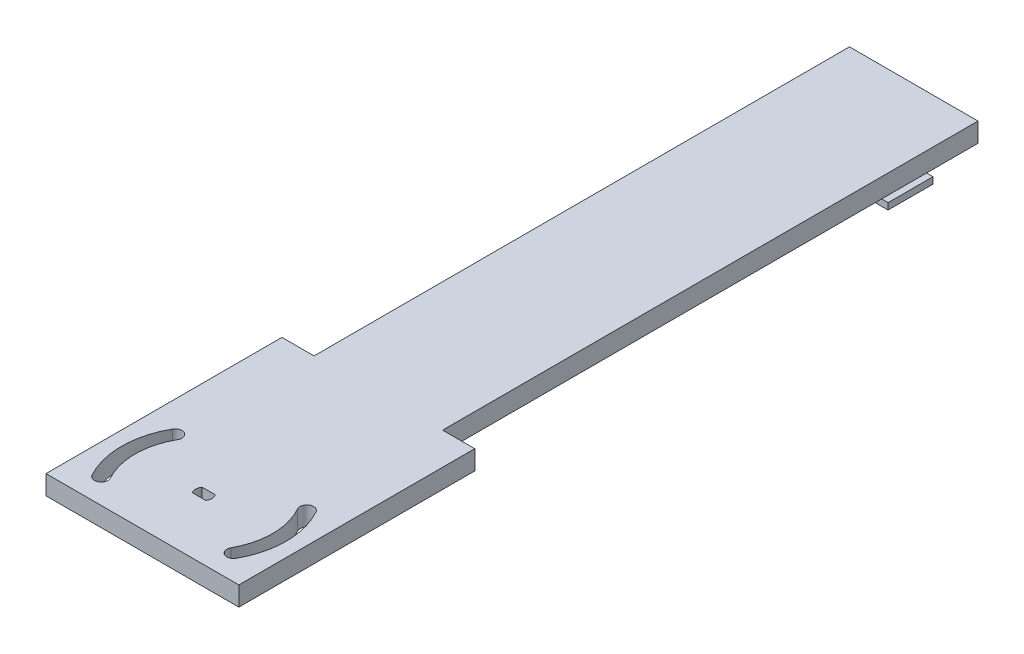
ISO-10303-21;
HEADER;
FILE_DESCRIPTION(('STEP AP214'),'2;1');
FILE_NAME('part.step','',(''),(''),'','','');
FILE_SCHEMA(('AUTOMOTIVE_DESIGN { 1 0 10303 214 1 1 1 1 }'));
ENDSEC;
DATA;
#1=APPLICATION_CONTEXT('core data for automotive mechanical design processes');
#2=APPLICATION_PROTOCOL_DEFINITION('international standard','automotive_design',2000,#1);
#3=PRODUCT_CONTEXT('',#1,'mechanical');
#4=PRODUCT('Part','Part','',(#3));
#5=PRODUCT_RELATED_PRODUCT_CATEGORY('part','',(#4));
#6=PRODUCT_DEFINITION_FORMATION('','',#4);
#7=PRODUCT_DEFINITION_CONTEXT('part definition',#1,'design');
#8=PRODUCT_DEFINITION('design','',#6,#7);
#9=PRODUCT_DEFINITION_SHAPE('','',#8);
#10=(LENGTH_UNIT() NAMED_UNIT(*) SI_UNIT(.MILLI.,.METRE.));
#11=(NAMED_UNIT(*) PLANE_ANGLE_UNIT() SI_UNIT($,.RADIAN.));
#12=(NAMED_UNIT(*) SI_UNIT($,.STERADIAN.) SOLID_ANGLE_UNIT());
#13=UNCERTAINTY_MEASURE_WITH_UNIT(LENGTH_MEASURE(1.E-05),#10,'distance_accuracy_value','');
#14=(GEOMETRIC_REPRESENTATION_CONTEXT(3) GLOBAL_UNCERTAINTY_ASSIGNED_CONTEXT((#13)) GLOBAL_UNIT_ASSIGNED_CONTEXT((#10,
#11,#12)) REPRESENTATION_CONTEXT('',''));
#15=CARTESIAN_POINT('',(0.,0.,0.));
#16=DIRECTION('',(0.,0.,1.));
#17=DIRECTION('',(1.,0.,0.));
#18=AXIS2_PLACEMENT_3D('',#15,#16,#17);
#19=CARTESIAN_POINT('',(0.,0.,0.));
#20=DIRECTION('',(0.,-1.,0.));
#21=DIRECTION('',(0.,0.,-1.));
#22=AXIS2_PLACEMENT_3D('',#19,#20,#21);
#23=PLANE('',#22);
#24=CARTESIAN_POINT('',(0.,0.,100.874369573321));
#25=DIRECTION('',(0.,-1.,0.));
#26=DIRECTION('',(0.,0.,1.));
#27=AXIS2_PLACEMENT_3D('',#24,#25,#26);
#28=CIRCLE('',#27,25.62);
#29=CARTESIAN_POINT('',(22.3176552587879,0.,88.2923719676189));
#30=VERTEX_POINT('',#29);
#31=CARTESIAN_POINT('',(22.4486515802957,0.,113.221127942484));
#32=VERTEX_POINT('',#31);
#33=EDGE_CURVE('E61',#30,#32,#28,.T.);
#34=ORIENTED_EDGE('',*,*,#33,.F.);
#35=CARTESIAN_POINT('',(20.4883392539692,0.,89.3236832467748));
#36=DIRECTION('',(0.,-1.,0.));
#37=DIRECTION('',(0.,0.,-1.));
#38=AXIS2_PLACEMENT_3D('',#35,#36,#37);
#39=CIRCLE('',#38,2.10000000000001);
#40=CARTESIAN_POINT('',(18.6590232491505,0.,90.3549945259307));
#41=VERTEX_POINT('',#40);
#42=EDGE_CURVE('E281',#41,#30,#39,.T.);
#43=ORIENTED_EDGE('',*,*,#42,.F.);
#44=CARTESIAN_POINT('',(0.,0.,100.874369573321));
#45=DIRECTION('',(0.,1.,0.));
#46=DIRECTION('',(0.,0.,1.));
#47=AXIS2_PLACEMENT_3D('',#44,#45,#46);
#48=CIRCLE('',#47,21.42);
#49=CARTESIAN_POINT('',(18.7685447638537,0.,111.197069193441));
#50=VERTEX_POINT('',#49);
#51=EDGE_CURVE('E285',#50,#41,#48,.T.);
#52=ORIENTED_EDGE('',*,*,#51,.F.);
#53=CARTESIAN_POINT('',(20.6085981720747,0.,112.209098567962));
#54=DIRECTION('',(0.,-1.,0.));
#55=DIRECTION('',(0.,0.,-1.));
#56=AXIS2_PLACEMENT_3D('',#53,#54,#55);
#57=CIRCLE('',#56,2.1);
#58=EDGE_CURVE('E240',#32,#50,#57,.T.);
#59=ORIENTED_EDGE('',*,*,#58,.F.);
#60=EDGE_LOOP('',(#34,#43,#52,#59));
#61=FACE_BOUND('',#60,.T.);
#62=CARTESIAN_POINT('',(-20.6085981720747,0.,112.209098567962));
#63=DIRECTION('',(0.,-1.,0.));
#64=DIRECTION('',(0.,0.,1.));
#65=AXIS2_PLACEMENT_3D('',#62,#63,#64);
#66=CIRCLE('',#65,2.1);
#67=CARTESIAN_POINT('',(-18.7685447638538,0.,111.197069193441));
#68=VERTEX_POINT('',#67);
#69=CARTESIAN_POINT('',(-22.4486515802957,0.,113.221127942484));
#70=VERTEX_POINT('',#69);
#71=EDGE_CURVE('E69',#68,#70,#66,.T.);
#72=ORIENTED_EDGE('',*,*,#71,.F.);
#73=CARTESIAN_POINT('',(0.,0.,100.874369573321));
#74=DIRECTION('',(0.,1.,0.));
#75=DIRECTION('',(0.,0.,1.));
#76=AXIS2_PLACEMENT_3D('',#73,#74,#75);
#77=CIRCLE('',#76,21.42);
#78=CARTESIAN_POINT('',(-18.6590232491505,0.,90.3549945259307));
#79=VERTEX_POINT('',#78);
#80=EDGE_CURVE('E243',#79,#68,#77,.T.);
#81=ORIENTED_EDGE('',*,*,#80,.F.);
#82=CARTESIAN_POINT('',(-20.4883392539692,0.,89.3236832467748));
#83=DIRECTION('',(0.,-1.,0.));
#84=DIRECTION('',(0.,0.,1.));
#85=AXIS2_PLACEMENT_3D('',#82,#83,#84);
#86=CIRCLE('',#85,2.1);
#87=CARTESIAN_POINT('',(-22.3176552587879,0.,88.2923719676189));
#88=VERTEX_POINT('',#87);
#89=EDGE_CURVE('E250',#88,#79,#86,.T.);
#90=ORIENTED_EDGE('',*,*,#89,.F.);
#91=CARTESIAN_POINT('',(0.,0.,100.874369573321));
#92=DIRECTION('',(0.,-1.,0.));
#93=DIRECTION('',(0.,0.,-1.));
#94=AXIS2_PLACEMENT_3D('',#91,#92,#93);
#95=CIRCLE('',#94,25.62);
#96=EDGE_CURVE('E256',#70,#88,#95,.T.);
#97=ORIENTED_EDGE('',*,*,#96,.F.);
#98=EDGE_LOOP('',(#72,#81,#90,#97));
#99=FACE_BOUND('',#98,.T.);
#100=CARTESIAN_POINT('',(0.,0.,100.874369573321));
#101=DIRECTION('',(0.,-1.,0.));
#102=DIRECTION('',(0.,0.,-1.));
#103=AXIS2_PLACEMENT_3D('',#100,#101,#102);
#104=CIRCLE('',#103,2.54017715917611);
#105=CARTESIAN_POINT('',(-2.05000000000002,0.,102.374369573321));
#106=VERTEX_POINT('',#105);
#107=CARTESIAN_POINT('',(-2.05000000000002,0.,99.3743695733212));
#108=VERTEX_POINT('',#107);
#109=EDGE_CURVE('E258',#106,#108,#104,.T.);
#110=ORIENTED_EDGE('',*,*,#109,.F.);
#111=DIRECTION('',(-1.,0.,0.));
#112=VECTOR('',#111,1.);
#113=CARTESIAN_POINT('',(-2.05000000000002,0.,102.374369573321));
#114=LINE('',#113,#112);
#115=CARTESIAN_POINT('',(2.04999999999998,0.,102.374369573321));
#116=VERTEX_POINT('',#115);
#117=EDGE_CURVE('E299',#116,#106,#114,.T.);
#118=ORIENTED_EDGE('',*,*,#117,.F.);
#119=CARTESIAN_POINT('',(0.,0.,100.874369573321));
#120=DIRECTION('',(0.,-1.,0.));
#121=DIRECTION('',(0.,0.,-1.));
#122=AXIS2_PLACEMENT_3D('',#119,#120,#121);
#123=CIRCLE('',#122,2.54017715917611);
#124=CARTESIAN_POINT('',(2.04999999999998,0.,99.3743695733212));
#125=VERTEX_POINT('',#124);
#126=EDGE_CURVE('E295',#125,#116,#123,.T.);
#127=ORIENTED_EDGE('',*,*,#126,.F.);
#128=DIRECTION('',(1.,0.,0.));
#129=VECTOR('',#128,1.);
#130=CARTESIAN_POINT('',(-2.05000000000002,0.,99.3743695733212));
#131=LINE('',#130,#129);
#132=EDGE_CURVE('E262',#108,#125,#131,.T.);
#133=ORIENTED_EDGE('',*,*,#132,.F.);
#134=EDGE_LOOP('',(#110,#118,#127,#133));
#135=FACE_BOUND('',#134,.T.);
#136=DIRECTION('',(0.,0.,-1.));
#137=VECTOR('',#136,1.);
#138=CARTESIAN_POINT('',(20.,0.,120.));
#139=LINE('',#138,#137);
#140=CARTESIAN_POINT('',(20.,0.,46.5869361591004));
#141=VERTEX_POINT('',#140);
#142=CARTESIAN_POINT('',(20.,0.,-120.));
#143=VERTEX_POINT('',#142);
#144=EDGE_CURVE('E448',#141,#143,#139,.T.);
#145=ORIENTED_EDGE('',*,*,#144,.F.);
#146=DIRECTION('',(1.,0.,0.));
#147=VECTOR('',#146,1.);
#148=CARTESIAN_POINT('',(-30.,0.,46.5869361591004));
#149=LINE('',#148,#147);
#150=CARTESIAN_POINT('',(30.,0.,46.5869361591004));
#151=VERTEX_POINT('',#150);
#152=EDGE_CURVE('E431',#141,#151,#149,.T.);
#153=ORIENTED_EDGE('',*,*,#152,.T.);
#154=DIRECTION('',(0.,0.,-1.));
#155=VECTOR('',#154,1.);
#156=CARTESIAN_POINT('',(30.,0.,120.));
#157=LINE('',#156,#155);
#158=CARTESIAN_POINT('',(30.,0.,120.));
#159=VERTEX_POINT('',#158);
#160=EDGE_CURVE('E403',#159,#151,#157,.T.);
#161=ORIENTED_EDGE('',*,*,#160,.F.);
#162=DIRECTION('',(1.,0.,0.));
#163=VECTOR('',#162,1.);
#164=CARTESIAN_POINT('',(-20.,0.,120.));
#165=LINE('',#164,#163);
#166=CARTESIAN_POINT('',(-30.,0.,120.));
#167=VERTEX_POINT('',#166);
#168=EDGE_CURVE('E453',#167,#159,#165,.T.);
#169=ORIENTED_EDGE('',*,*,#168,.F.);
#170=DIRECTION('',(0.,0.,-1.));
#171=VECTOR('',#170,1.);
#172=CARTESIAN_POINT('',(-30.,0.,120.));
#173=LINE('',#172,#171);
#174=CARTESIAN_POINT('',(-30.,0.,46.5869361591004));
#175=VERTEX_POINT('',#174);
#176=EDGE_CURVE('E419',#167,#175,#173,.T.);
#177=ORIENTED_EDGE('',*,*,#176,.T.);
#178=CARTESIAN_POINT('',(-20.,0.,46.5869361591004));
#179=VERTEX_POINT('',#178);
#180=EDGE_CURVE('E438',#175,#179,#149,.T.);
#181=ORIENTED_EDGE('',*,*,#180,.T.);
#182=DIRECTION('',(0.,0.,1.));
#183=VECTOR('',#182,1.);
#184=CARTESIAN_POINT('',(-20.,0.,120.));
#185=LINE('',#184,#183);
#186=CARTESIAN_POINT('',(-20.,0.,-120.));
#187=VERTEX_POINT('',#186);
#188=EDGE_CURVE('E469',#187,#179,#185,.T.);
#189=ORIENTED_EDGE('',*,*,#188,.F.);
#190=DIRECTION('',(-1.,0.,0.));
#191=VECTOR('',#190,1.);
#192=CARTESIAN_POINT('',(-20.,0.,-120.));
#193=LINE('',#192,#191);
#194=EDGE_CURVE('E466',#143,#187,#193,.T.);
#195=ORIENTED_EDGE('',*,*,#194,.F.);
#196=EDGE_LOOP('',(#145,#153,#161,#169,#177,#181,#189,#195));
#197=FACE_BOUND('',#196,.T.);
#198=DIRECTION('',(1.,0.,0.));
#199=VECTOR('',#198,1.);
#200=CARTESIAN_POINT('',(-14.,0.,-110.));
#201=LINE('',#200,#199);
#202=CARTESIAN_POINT('',(-14.,0.,-110.));
#203=VERTEX_POINT('',#202);
#204=CARTESIAN_POINT('',(14.,0.,-110.));
#205=VERTEX_POINT('',#204);
#206=EDGE_CURVE('E377',#203,#205,#201,.T.);
#207=ORIENTED_EDGE('',*,*,#206,.F.);
#208=DIRECTION('',(0.,0.,-1.));
#209=VECTOR('',#208,1.);
#210=CARTESIAN_POINT('',(-14.,0.,-110.));
#211=LINE('',#210,#209);
#212=CARTESIAN_POINT('',(-14.,0.,-96.));
#213=VERTEX_POINT('',#212);
#214=EDGE_CURVE('E365',#213,#203,#211,.T.);
#215=ORIENTED_EDGE('',*,*,#214,.F.);
#216=DIRECTION('',(-1.,0.,0.));
#217=VECTOR('',#216,1.);
#218=CARTESIAN_POINT('',(-14.,0.,-96.));
#219=LINE('',#218,#217);
#220=CARTESIAN_POINT('',(14.,0.,-96.));
#221=VERTEX_POINT('',#220);
#222=EDGE_CURVE('E370',#221,#213,#219,.T.);
#223=ORIENTED_EDGE('',*,*,#222,.F.);
#224=DIRECTION('',(0.,0.,1.));
#225=VECTOR('',#224,1.);
#226=CARTESIAN_POINT('',(14.,0.,-110.));
#227=LINE('',#226,#225);
#228=EDGE_CURVE('E381',#205,#221,#227,.T.);
#229=ORIENTED_EDGE('',*,*,#228,.F.);
#230=EDGE_LOOP('',(#207,#215,#223,#229));
#231=FACE_BOUND('',#230,.T.);
#232=ADVANCED_FACE('F45',(#61,#99,#135,#197,#231),#23,.T.);
#233=CARTESIAN_POINT('',(20.,6.,120.));
#234=DIRECTION('',(-1.,0.,0.));
#235=DIRECTION('',(0.,0.,1.));
#236=AXIS2_PLACEMENT_3D('',#233,#234,#235);
#237=PLANE('',#236);
#238=DIRECTION('',(0.,0.,-1.));
#239=VECTOR('',#238,1.);
#240=CARTESIAN_POINT('',(20.,6.,120.));
#241=LINE('',#240,#239);
#242=CARTESIAN_POINT('',(20.,6.,46.5869361591004));
#243=VERTEX_POINT('',#242);
#244=CARTESIAN_POINT('',(20.,6.,-120.));
#245=VERTEX_POINT('',#244);
#246=EDGE_CURVE('E449',#243,#245,#241,.T.);
#247=ORIENTED_EDGE('',*,*,#246,.F.);
#248=DIRECTION('',(0.,-1.,0.));
#249=VECTOR('',#248,1.);
#250=CARTESIAN_POINT('',(20.,6.,46.5869361591004));
#251=LINE('',#250,#249);
#252=EDGE_CURVE('E444',#243,#141,#251,.T.);
#253=ORIENTED_EDGE('',*,*,#252,.T.);
#254=ORIENTED_EDGE('',*,*,#144,.T.);
#255=DIRECTION('',(0.,-1.,0.));
#256=VECTOR('',#255,1.);
#257=CARTESIAN_POINT('',(20.,6.,-120.));
#258=LINE('',#257,#256);
#259=EDGE_CURVE('E477',#245,#143,#258,.T.);
#260=ORIENTED_EDGE('',*,*,#259,.F.);
#261=EDGE_LOOP('',(#247,#253,#254,#260));
#262=FACE_BOUND('',#261,.T.);
#263=ADVANCED_FACE('F47',(#262),#237,.F.);
#264=CARTESIAN_POINT('',(-20.,6.,-120.));
#265=DIRECTION('',(0.,0.,1.));
#266=DIRECTION('',(1.,0.,0.));
#267=AXIS2_PLACEMENT_3D('',#264,#265,#266);
#268=PLANE('',#267);
#269=ORIENTED_EDGE('',*,*,#194,.T.);
#270=DIRECTION('',(0.,-1.,0.));
#271=VECTOR('',#270,1.);
#272=CARTESIAN_POINT('',(-20.,6.,-120.));
#273=LINE('',#272,#271);
#274=CARTESIAN_POINT('',(-20.,6.,-120.));
#275=VERTEX_POINT('',#274);
#276=EDGE_CURVE('E463',#275,#187,#273,.T.);
#277=ORIENTED_EDGE('',*,*,#276,.F.);
#278=DIRECTION('',(-1.,0.,0.));
#279=VECTOR('',#278,1.);
#280=CARTESIAN_POINT('',(-20.,6.,-120.));
#281=LINE('',#280,#279);
#282=EDGE_CURVE('E452',#245,#275,#281,.T.);
#283=ORIENTED_EDGE('',*,*,#282,.F.);
#284=ORIENTED_EDGE('',*,*,#259,.T.);
#285=EDGE_LOOP('',(#269,#277,#283,#284));
#286=FACE_BOUND('',#285,.T.);
#287=ADVANCED_FACE('F555',(#286),#268,.F.);
#288=CARTESIAN_POINT('',(-20.,6.,120.));
#289=DIRECTION('',(1.,0.,0.));
#290=DIRECTION('',(0.,0.,-1.));
#291=AXIS2_PLACEMENT_3D('',#288,#289,#290);
#292=PLANE('',#291);
#293=ORIENTED_EDGE('',*,*,#188,.T.);
#294=DIRECTION('',(0.,1.,0.));
#295=VECTOR('',#294,1.);
#296=CARTESIAN_POINT('',(-20.,6.,46.5869361591004));
#297=LINE('',#296,#295);
#298=CARTESIAN_POINT('',(-20.,6.,46.5869361591004));
#299=VERTEX_POINT('',#298);
#300=EDGE_CURVE('E436',#179,#299,#297,.T.);
#301=ORIENTED_EDGE('',*,*,#300,.T.);
#302=DIRECTION('',(0.,0.,1.));
#303=VECTOR('',#302,1.);
#304=CARTESIAN_POINT('',(-20.,6.,120.));
#305=LINE('',#304,#303);
#306=EDGE_CURVE('E456',#275,#299,#305,.T.);
#307=ORIENTED_EDGE('',*,*,#306,.F.);
#308=ORIENTED_EDGE('',*,*,#276,.T.);
#309=EDGE_LOOP('',(#293,#301,#307,#308));
#310=FACE_BOUND('',#309,.T.);
#311=ADVANCED_FACE('F563',(#310),#292,.F.);
#312=CARTESIAN_POINT('',(-20.,6.,120.));
#313=DIRECTION('',(0.,0.,-1.));
#314=DIRECTION('',(-1.,0.,0.));
#315=AXIS2_PLACEMENT_3D('',#312,#313,#314);
#316=PLANE('',#315);
#317=ORIENTED_EDGE('',*,*,#168,.T.);
#318=DIRECTION('',(0.,-1.,0.));
#319=VECTOR('',#318,1.);
#320=CARTESIAN_POINT('',(30.,6.,120.));
#321=LINE('',#320,#319);
#322=CARTESIAN_POINT('',(30.,6.,120.));
#323=VERTEX_POINT('',#322);
#324=EDGE_CURVE('E399',#323,#159,#321,.T.);
#325=ORIENTED_EDGE('',*,*,#324,.F.);
#326=DIRECTION('',(1.,0.,0.));
#327=VECTOR('',#326,1.);
#328=CARTESIAN_POINT('',(-20.,6.,120.));
#329=LINE('',#328,#327);
#330=CARTESIAN_POINT('',(-30.,6.,120.));
#331=VERTEX_POINT('',#330);
#332=EDGE_CURVE('E460',#331,#323,#329,.T.);
#333=ORIENTED_EDGE('',*,*,#332,.F.);
#334=DIRECTION('',(0.,-1.,0.));
#335=VECTOR('',#334,1.);
#336=CARTESIAN_POINT('',(-30.,6.,120.));
#337=LINE('',#336,#335);
#338=EDGE_CURVE('E415',#331,#167,#337,.T.);
#339=ORIENTED_EDGE('',*,*,#338,.T.);
#340=EDGE_LOOP('',(#317,#325,#333,#339));
#341=FACE_BOUND('',#340,.T.);
#342=ADVANCED_FACE('F560',(#341),#316,.F.);
#343=CARTESIAN_POINT('',(0.,6.,0.));
#344=DIRECTION('',(0.,-1.,0.));
#345=DIRECTION('',(0.,0.,-1.));
#346=AXIS2_PLACEMENT_3D('',#343,#344,#345);
#347=PLANE('',#346);
#348=CARTESIAN_POINT('',(20.4883392539692,6.,89.3236832467748));
#349=DIRECTION('',(0.,-1.,0.));
#350=DIRECTION('',(0.,0.,-1.));
#351=AXIS2_PLACEMENT_3D('',#348,#349,#350);
#352=CIRCLE('',#351,2.10000000000001);
#353=CARTESIAN_POINT('',(18.6590232491505,6.,90.3549945259307));
#354=VERTEX_POINT('',#353);
#355=CARTESIAN_POINT('',(22.3176552587879,6.,88.2923719676189));
#356=VERTEX_POINT('',#355);
#357=EDGE_CURVE('E54',#354,#356,#352,.T.);
#358=ORIENTED_EDGE('',*,*,#357,.T.);
#359=CARTESIAN_POINT('',(0.,6.,100.874369573321));
#360=DIRECTION('',(0.,-1.,0.));
#361=DIRECTION('',(0.,0.,-1.));
#362=AXIS2_PLACEMENT_3D('',#359,#360,#361);
#363=CIRCLE('',#362,25.62);
#364=CARTESIAN_POINT('',(22.4486515802957,6.,113.221127942484));
#365=VERTEX_POINT('',#364);
#366=EDGE_CURVE('E11',#356,#365,#363,.T.);
#367=ORIENTED_EDGE('',*,*,#366,.T.);
#368=CARTESIAN_POINT('',(20.6085981720747,6.,112.209098567962));
#369=DIRECTION('',(0.,-1.,0.));
#370=DIRECTION('',(0.,0.,-1.));
#371=AXIS2_PLACEMENT_3D('',#368,#369,#370);
#372=CIRCLE('',#371,2.1);
#373=CARTESIAN_POINT('',(18.7685447638537,6.,111.197069193441));
#374=VERTEX_POINT('',#373);
#375=EDGE_CURVE('E510',#365,#374,#372,.T.);
#376=ORIENTED_EDGE('',*,*,#375,.T.);
#377=CARTESIAN_POINT('',(0.,6.,100.874369573321));
#378=DIRECTION('',(0.,-1.,0.));
#379=DIRECTION('',(0.,0.,-1.));
#380=AXIS2_PLACEMENT_3D('',#377,#378,#379);
#381=CIRCLE('',#380,21.42);
#382=EDGE_CURVE('E514',#374,#354,#381,.F.);
#383=ORIENTED_EDGE('',*,*,#382,.T.);
#384=EDGE_LOOP('',(#358,#367,#376,#383));
#385=FACE_BOUND('',#384,.T.);
#386=CARTESIAN_POINT('',(0.,6.,100.874369573321));
#387=DIRECTION('',(0.,-1.,0.));
#388=DIRECTION('',(0.,0.,-1.));
#389=AXIS2_PLACEMENT_3D('',#386,#387,#388);
#390=CIRCLE('',#389,21.42);
#391=CARTESIAN_POINT('',(-18.6590232491505,6.,90.3549945259307));
#392=VERTEX_POINT('',#391);
#393=CARTESIAN_POINT('',(-18.7685447638538,6.,111.197069193441));
#394=VERTEX_POINT('',#393);
#395=EDGE_CURVE('E505',#392,#394,#390,.F.);
#396=ORIENTED_EDGE('',*,*,#395,.T.);
#397=CARTESIAN_POINT('',(-20.6085981720747,6.,112.209098567962));
#398=DIRECTION('',(0.,-1.,0.));
#399=DIRECTION('',(0.,0.,-1.));
#400=AXIS2_PLACEMENT_3D('',#397,#398,#399);
#401=CIRCLE('',#400,2.1);
#402=CARTESIAN_POINT('',(-22.4486515802957,6.,113.221127942484));
#403=VERTEX_POINT('',#402);
#404=EDGE_CURVE('E235',#394,#403,#401,.T.);
#405=ORIENTED_EDGE('',*,*,#404,.T.);
#406=CARTESIAN_POINT('',(0.,6.,100.874369573321));
#407=DIRECTION('',(0.,-1.,0.));
#408=DIRECTION('',(0.,0.,-1.));
#409=AXIS2_PLACEMENT_3D('',#406,#407,#408);
#410=CIRCLE('',#409,25.62);
#411=CARTESIAN_POINT('',(-22.3176552587879,6.,88.2923719676189));
#412=VERTEX_POINT('',#411);
#413=EDGE_CURVE('E497',#403,#412,#410,.T.);
#414=ORIENTED_EDGE('',*,*,#413,.T.);
#415=CARTESIAN_POINT('',(-20.4883392539692,6.,89.3236832467748));
#416=DIRECTION('',(0.,-1.,0.));
#417=DIRECTION('',(0.,0.,-1.));
#418=AXIS2_PLACEMENT_3D('',#415,#416,#417);
#419=CIRCLE('',#418,2.1);
#420=EDGE_CURVE('E501',#412,#392,#419,.T.);
#421=ORIENTED_EDGE('',*,*,#420,.T.);
#422=EDGE_LOOP('',(#396,#405,#414,#421));
#423=FACE_BOUND('',#422,.T.);
#424=DIRECTION('',(-1.,0.,0.));
#425=VECTOR('',#424,1.);
#426=CARTESIAN_POINT('',(0.,6.,102.374369573321));
#427=LINE('',#426,#425);
#428=CARTESIAN_POINT('',(2.04999999999998,6.,102.374369573321));
#429=VERTEX_POINT('',#428);
#430=CARTESIAN_POINT('',(-2.05000000000002,6.,102.374369573321));
#431=VERTEX_POINT('',#430);
#432=EDGE_CURVE('E489',#429,#431,#427,.T.);
#433=ORIENTED_EDGE('',*,*,#432,.T.);
#434=CARTESIAN_POINT('',(0.,6.,100.874369573321));
#435=DIRECTION('',(0.,-1.,0.));
#436=DIRECTION('',(0.,0.,-1.));
#437=AXIS2_PLACEMENT_3D('',#434,#435,#436);
#438=CIRCLE('',#437,2.54017715917611);
#439=CARTESIAN_POINT('',(-2.05000000000002,6.,99.3743695733212));
#440=VERTEX_POINT('',#439);
#441=EDGE_CURVE('E493',#431,#440,#438,.T.);
#442=ORIENTED_EDGE('',*,*,#441,.T.);
#443=DIRECTION('',(1.,0.,0.));
#444=VECTOR('',#443,1.);
#445=CARTESIAN_POINT('',(0.,6.,99.3743695733212));
#446=LINE('',#445,#444);
#447=CARTESIAN_POINT('',(2.04999999999998,6.,99.3743695733212));
#448=VERTEX_POINT('',#447);
#449=EDGE_CURVE('E481',#440,#448,#446,.T.);
#450=ORIENTED_EDGE('',*,*,#449,.T.);
#451=CARTESIAN_POINT('',(0.,6.,100.874369573321));
#452=DIRECTION('',(0.,-1.,0.));
#453=DIRECTION('',(0.,0.,-1.));
#454=AXIS2_PLACEMENT_3D('',#451,#452,#453);
#455=CIRCLE('',#454,2.54017715917611);
#456=EDGE_CURVE('E485',#448,#429,#455,.T.);
#457=ORIENTED_EDGE('',*,*,#456,.T.);
#458=EDGE_LOOP('',(#433,#442,#450,#457));
#459=FACE_BOUND('',#458,.T.);
#460=ORIENTED_EDGE('',*,*,#306,.T.);
#461=DIRECTION('',(1.,0.,0.));
#462=VECTOR('',#461,1.);
#463=CARTESIAN_POINT('',(-30.,6.,46.5869361591004));
#464=LINE('',#463,#462);
#465=CARTESIAN_POINT('',(-30.,6.,46.5869361591004));
#466=VERTEX_POINT('',#465);
#467=EDGE_CURVE('E432',#466,#299,#464,.T.);
#468=ORIENTED_EDGE('',*,*,#467,.F.);
#469=DIRECTION('',(0.,0.,1.));
#470=VECTOR('',#469,1.);
#471=CARTESIAN_POINT('',(-30.,6.,120.));
#472=LINE('',#471,#470);
#473=EDGE_CURVE('E427',#466,#331,#472,.T.);
#474=ORIENTED_EDGE('',*,*,#473,.T.);
#475=ORIENTED_EDGE('',*,*,#332,.T.);
#476=DIRECTION('',(0.,0.,1.));
#477=VECTOR('',#476,1.);
#478=CARTESIAN_POINT('',(30.,6.,120.));
#479=LINE('',#478,#477);
#480=CARTESIAN_POINT('',(30.,6.,46.5869361591004));
#481=VERTEX_POINT('',#480);
#482=EDGE_CURVE('E411',#481,#323,#479,.T.);
#483=ORIENTED_EDGE('',*,*,#482,.F.);
#484=EDGE_CURVE('E437',#243,#481,#464,.T.);
#485=ORIENTED_EDGE('',*,*,#484,.F.);
#486=ORIENTED_EDGE('',*,*,#246,.T.);
#487=ORIENTED_EDGE('',*,*,#282,.T.);
#488=EDGE_LOOP('',(#460,#468,#474,#475,#483,#485,#486,#487));
#489=FACE_BOUND('',#488,.T.);
#490=ADVANCED_FACE('F520',(#385,#423,#459,#489),#347,.F.);
#491=CARTESIAN_POINT('',(-30.,0.,0.));
#492=DIRECTION('',(1.,0.,0.));
#493=DIRECTION('',(0.,0.,-1.));
#494=AXIS2_PLACEMENT_3D('',#491,#492,#493);
#495=PLANE('',#494);
#496=ORIENTED_EDGE('',*,*,#338,.F.);
#497=ORIENTED_EDGE('',*,*,#473,.F.);
#498=DIRECTION('',(0.,1.,0.));
#499=VECTOR('',#498,1.);
#500=CARTESIAN_POINT('',(-30.,6.,46.5869361591004));
#501=LINE('',#500,#499);
#502=EDGE_CURVE('E423',#175,#466,#501,.T.);
#503=ORIENTED_EDGE('',*,*,#502,.F.);
#504=ORIENTED_EDGE('',*,*,#176,.F.);
#505=EDGE_LOOP('',(#496,#497,#503,#504));
#506=FACE_BOUND('',#505,.T.);
#507=ADVANCED_FACE('F587',(#506),#495,.F.);
#508=CARTESIAN_POINT('',(-30.,6.,46.5869361591004));
#509=DIRECTION('',(0.,0.,-1.));
#510=DIRECTION('',(-1.,0.,0.));
#511=AXIS2_PLACEMENT_3D('',#508,#509,#510);
#512=PLANE('',#511);
#513=ORIENTED_EDGE('',*,*,#300,.F.);
#514=ORIENTED_EDGE('',*,*,#180,.F.);
#515=ORIENTED_EDGE('',*,*,#502,.T.);
#516=ORIENTED_EDGE('',*,*,#467,.T.);
#517=EDGE_LOOP('',(#513,#514,#515,#516));
#518=FACE_BOUND('',#517,.T.);
#519=ADVANCED_FACE('F583',(#518),#512,.T.);
#520=ORIENTED_EDGE('',*,*,#252,.F.);
#521=ORIENTED_EDGE('',*,*,#484,.T.);
#522=DIRECTION('',(0.,1.,0.));
#523=VECTOR('',#522,1.);
#524=CARTESIAN_POINT('',(30.,6.,46.5869361591004));
#525=LINE('',#524,#523);
#526=EDGE_CURVE('E407',#151,#481,#525,.T.);
#527=ORIENTED_EDGE('',*,*,#526,.F.);
#528=ORIENTED_EDGE('',*,*,#152,.F.);
#529=EDGE_LOOP('',(#520,#521,#527,#528));
#530=FACE_BOUND('',#529,.T.);
#531=ADVANCED_FACE('F600',(#530),#512,.T.);
#532=CARTESIAN_POINT('',(30.,0.,0.));
#533=DIRECTION('',(1.,0.,0.));
#534=DIRECTION('',(0.,0.,-1.));
#535=AXIS2_PLACEMENT_3D('',#532,#533,#534);
#536=PLANE('',#535);
#537=ORIENTED_EDGE('',*,*,#324,.T.);
#538=ORIENTED_EDGE('',*,*,#160,.T.);
#539=ORIENTED_EDGE('',*,*,#526,.T.);
#540=ORIENTED_EDGE('',*,*,#482,.T.);
#541=EDGE_LOOP('',(#537,#538,#539,#540));
#542=FACE_BOUND('',#541,.T.);
#543=ADVANCED_FACE('F598',(#542),#536,.T.);
#544=CARTESIAN_POINT('',(-14.,-8.,-110.));
#545=DIRECTION('',(1.,0.,0.));
#546=DIRECTION('',(0.,0.,-1.));
#547=AXIS2_PLACEMENT_3D('',#544,#545,#546);
#548=PLANE('',#547);
#549=DIRECTION('',(0.,1.,0.));
#550=VECTOR('',#549,1.);
#551=CARTESIAN_POINT('',(-14.,-8.,-110.));
#552=LINE('',#551,#550);
#553=CARTESIAN_POINT('',(-14.,-6.,-110.));
#554=VERTEX_POINT('',#553);
#555=EDGE_CURVE('E396',#554,#203,#552,.T.);
#556=ORIENTED_EDGE('',*,*,#555,.F.);
#557=DIRECTION('',(0.,0.,1.));
#558=VECTOR('',#557,1.);
#559=CARTESIAN_POINT('',(-14.,-6.,-110.));
#560=LINE('',#559,#558);
#561=CARTESIAN_POINT('',(-14.,-6.,-96.));
#562=VERTEX_POINT('',#561);
#563=EDGE_CURVE('E361',#554,#562,#560,.T.);
#564=ORIENTED_EDGE('',*,*,#563,.T.);
#565=DIRECTION('',(0.,1.,0.));
#566=VECTOR('',#565,1.);
#567=CARTESIAN_POINT('',(-14.,-8.,-96.));
#568=LINE('',#567,#566);
#569=EDGE_CURVE('E373',#562,#213,#568,.T.);
#570=ORIENTED_EDGE('',*,*,#569,.T.);
#571=ORIENTED_EDGE('',*,*,#214,.T.);
#572=EDGE_LOOP('',(#556,#564,#570,#571));
#573=FACE_BOUND('',#572,.T.);
#574=ADVANCED_FACE('F629',(#573),#548,.F.);
#575=CARTESIAN_POINT('',(-14.,-8.,-110.));
#576=DIRECTION('',(0.,0.,1.));
#577=DIRECTION('',(1.,0.,0.));
#578=AXIS2_PLACEMENT_3D('',#575,#576,#577);
#579=PLANE('',#578);
#580=DIRECTION('',(0.,1.,0.));
#581=VECTOR('',#580,1.);
#582=CARTESIAN_POINT('',(14.,-8.,-110.));
#583=LINE('',#582,#581);
#584=CARTESIAN_POINT('',(14.,-6.,-110.));
#585=VERTEX_POINT('',#584);
#586=EDGE_CURVE('E393',#585,#205,#583,.T.);
#587=ORIENTED_EDGE('',*,*,#586,.F.);
#588=DIRECTION('',(1.,0.,0.));
#589=VECTOR('',#588,1.);
#590=CARTESIAN_POINT('',(-16.,-6.,-110.));
#591=LINE('',#590,#589);
#592=CARTESIAN_POINT('',(16.,-6.,-110.));
#593=VERTEX_POINT('',#592);
#594=EDGE_CURVE('E348',#585,#593,#591,.T.);
#595=ORIENTED_EDGE('',*,*,#594,.T.);
#596=DIRECTION('',(0.,1.,0.));
#597=VECTOR('',#596,1.);
#598=CARTESIAN_POINT('',(16.,-8.,-110.));
#599=LINE('',#598,#597);
#600=CARTESIAN_POINT('',(16.,-8.,-110.));
#601=VERTEX_POINT('',#600);
#602=EDGE_CURVE('E324',#601,#593,#599,.T.);
#603=ORIENTED_EDGE('',*,*,#602,.F.);
#604=DIRECTION('',(1.,0.,0.));
#605=VECTOR('',#604,1.);
#606=CARTESIAN_POINT('',(-14.,-8.,-110.));
#607=LINE('',#606,#605);
#608=CARTESIAN_POINT('',(-16.,-8.,-110.));
#609=VERTEX_POINT('',#608);
#610=EDGE_CURVE('E366',#609,#601,#607,.T.);
#611=ORIENTED_EDGE('',*,*,#610,.F.);
#612=DIRECTION('',(0.,1.,0.));
#613=VECTOR('',#612,1.);
#614=CARTESIAN_POINT('',(-16.,-8.,-110.));
#615=LINE('',#614,#613);
#616=CARTESIAN_POINT('',(-16.,-6.,-110.));
#617=VERTEX_POINT('',#616);
#618=EDGE_CURVE('E340',#609,#617,#615,.T.);
#619=ORIENTED_EDGE('',*,*,#618,.T.);
#620=EDGE_CURVE('E354',#617,#554,#591,.T.);
#621=ORIENTED_EDGE('',*,*,#620,.T.);
#622=ORIENTED_EDGE('',*,*,#555,.T.);
#623=ORIENTED_EDGE('',*,*,#206,.T.);
#624=EDGE_LOOP('',(#587,#595,#603,#611,#619,#621,#622,#623));
#625=FACE_BOUND('',#624,.T.);
#626=ADVANCED_FACE('F607',(#625),#579,.F.);
#627=CARTESIAN_POINT('',(14.,-8.,-110.));
#628=DIRECTION('',(-1.,0.,0.));
#629=DIRECTION('',(0.,0.,1.));
#630=AXIS2_PLACEMENT_3D('',#627,#628,#629);
#631=PLANE('',#630);
#632=DIRECTION('',(0.,1.,0.));
#633=VECTOR('',#632,1.);
#634=CARTESIAN_POINT('',(14.,-8.,-96.));
#635=LINE('',#634,#633);
#636=CARTESIAN_POINT('',(14.,-6.,-96.));
#637=VERTEX_POINT('',#636);
#638=EDGE_CURVE('E390',#637,#221,#635,.T.);
#639=ORIENTED_EDGE('',*,*,#638,.F.);
#640=DIRECTION('',(0.,0.,-1.));
#641=VECTOR('',#640,1.);
#642=CARTESIAN_POINT('',(14.,-6.,-110.));
#643=LINE('',#642,#641);
#644=EDGE_CURVE('E352',#637,#585,#643,.T.);
#645=ORIENTED_EDGE('',*,*,#644,.T.);
#646=ORIENTED_EDGE('',*,*,#586,.T.);
#647=ORIENTED_EDGE('',*,*,#228,.T.);
#648=EDGE_LOOP('',(#639,#645,#646,#647));
#649=FACE_BOUND('',#648,.T.);
#650=ADVANCED_FACE('F621',(#649),#631,.F.);
#651=CARTESIAN_POINT('',(-14.,-8.,-96.));
#652=DIRECTION('',(0.,0.,-1.));
#653=DIRECTION('',(-1.,0.,0.));
#654=AXIS2_PLACEMENT_3D('',#651,#652,#653);
#655=PLANE('',#654);
#656=ORIENTED_EDGE('',*,*,#569,.F.);
#657=DIRECTION('',(1.,0.,0.));
#658=VECTOR('',#657,1.);
#659=CARTESIAN_POINT('',(-16.,-6.,-96.));
#660=LINE('',#659,#658);
#661=CARTESIAN_POINT('',(-16.,-6.,-96.));
#662=VERTEX_POINT('',#661);
#663=EDGE_CURVE('E349',#662,#562,#660,.T.);
#664=ORIENTED_EDGE('',*,*,#663,.F.);
#665=DIRECTION('',(0.,-1.,0.));
#666=VECTOR('',#665,1.);
#667=CARTESIAN_POINT('',(-16.,-8.,-96.));
#668=LINE('',#667,#666);
#669=CARTESIAN_POINT('',(-16.,-8.,-96.));
#670=VERTEX_POINT('',#669);
#671=EDGE_CURVE('E332',#662,#670,#668,.T.);
#672=ORIENTED_EDGE('',*,*,#671,.T.);
#673=DIRECTION('',(-1.,0.,0.));
#674=VECTOR('',#673,1.);
#675=CARTESIAN_POINT('',(-14.,-8.,-96.));
#676=LINE('',#675,#674);
#677=CARTESIAN_POINT('',(16.,-8.,-96.));
#678=VERTEX_POINT('',#677);
#679=EDGE_CURVE('E369',#678,#670,#676,.T.);
#680=ORIENTED_EDGE('',*,*,#679,.F.);
#681=DIRECTION('',(0.,-1.,0.));
#682=VECTOR('',#681,1.);
#683=CARTESIAN_POINT('',(16.,-8.,-96.));
#684=LINE('',#683,#682);
#685=CARTESIAN_POINT('',(16.,-6.,-96.));
#686=VERTEX_POINT('',#685);
#687=EDGE_CURVE('E307',#686,#678,#684,.T.);
#688=ORIENTED_EDGE('',*,*,#687,.F.);
#689=EDGE_CURVE('E353',#637,#686,#660,.T.);
#690=ORIENTED_EDGE('',*,*,#689,.F.);
#691=ORIENTED_EDGE('',*,*,#638,.T.);
#692=ORIENTED_EDGE('',*,*,#222,.T.);
#693=EDGE_LOOP('',(#656,#664,#672,#680,#688,#690,#691,#692));
#694=FACE_BOUND('',#693,.T.);
#695=ADVANCED_FACE('F619',(#694),#655,.F.);
#696=CARTESIAN_POINT('',(0.,-8.,0.));
#697=DIRECTION('',(0.,1.,0.));
#698=DIRECTION('',(0.,0.,1.));
#699=AXIS2_PLACEMENT_3D('',#696,#697,#698);
#700=PLANE('',#699);
#701=ORIENTED_EDGE('',*,*,#679,.T.);
#702=DIRECTION('',(0.,0.,-1.));
#703=VECTOR('',#702,1.);
#704=CARTESIAN_POINT('',(-16.,-8.,-96.));
#705=LINE('',#704,#703);
#706=EDGE_CURVE('E336',#670,#609,#705,.T.);
#707=ORIENTED_EDGE('',*,*,#706,.T.);
#708=ORIENTED_EDGE('',*,*,#610,.T.);
#709=DIRECTION('',(0.,0.,-1.));
#710=VECTOR('',#709,1.);
#711=CARTESIAN_POINT('',(16.,-8.,-96.));
#712=LINE('',#711,#710);
#713=EDGE_CURVE('E320',#678,#601,#712,.T.);
#714=ORIENTED_EDGE('',*,*,#713,.F.);
#715=EDGE_LOOP('',(#701,#707,#708,#714));
#716=FACE_BOUND('',#715,.T.);
#717=ADVANCED_FACE('F638',(#716),#700,.F.);
#718=CARTESIAN_POINT('',(16.,0.,0.));
#719=DIRECTION('',(-1.,0.,0.));
#720=DIRECTION('',(0.,0.,1.));
#721=AXIS2_PLACEMENT_3D('',#718,#719,#720);
#722=PLANE('',#721);
#723=ORIENTED_EDGE('',*,*,#687,.T.);
#724=ORIENTED_EDGE('',*,*,#713,.T.);
#725=ORIENTED_EDGE('',*,*,#602,.T.);
#726=DIRECTION('',(0.,0.,1.));
#727=VECTOR('',#726,1.);
#728=CARTESIAN_POINT('',(16.,-6.,-96.));
#729=LINE('',#728,#727);
#730=EDGE_CURVE('E328',#593,#686,#729,.T.);
#731=ORIENTED_EDGE('',*,*,#730,.T.);
#732=EDGE_LOOP('',(#723,#724,#725,#731));
#733=FACE_BOUND('',#732,.T.);
#734=ADVANCED_FACE('F611',(#733),#722,.F.);
#735=CARTESIAN_POINT('',(-16.,-6.,-96.));
#736=DIRECTION('',(0.,1.,0.));
#737=DIRECTION('',(0.,0.,1.));
#738=AXIS2_PLACEMENT_3D('',#735,#736,#737);
#739=PLANE('',#738);
#740=ORIENTED_EDGE('',*,*,#644,.F.);
#741=ORIENTED_EDGE('',*,*,#689,.T.);
#742=ORIENTED_EDGE('',*,*,#730,.F.);
#743=ORIENTED_EDGE('',*,*,#594,.F.);
#744=EDGE_LOOP('',(#740,#741,#742,#743));
#745=FACE_BOUND('',#744,.T.);
#746=ADVANCED_FACE('F614',(#745),#739,.T.);
#747=ORIENTED_EDGE('',*,*,#563,.F.);
#748=ORIENTED_EDGE('',*,*,#620,.F.);
#749=DIRECTION('',(0.,0.,1.));
#750=VECTOR('',#749,1.);
#751=CARTESIAN_POINT('',(-16.,-6.,-96.));
#752=LINE('',#751,#750);
#753=EDGE_CURVE('E344',#617,#662,#752,.T.);
#754=ORIENTED_EDGE('',*,*,#753,.T.);
#755=ORIENTED_EDGE('',*,*,#663,.T.);
#756=EDGE_LOOP('',(#747,#748,#754,#755));
#757=FACE_BOUND('',#756,.T.);
#758=ADVANCED_FACE('F631',(#757),#739,.T.);
#759=CARTESIAN_POINT('',(-16.,0.,0.));
#760=DIRECTION('',(-1.,0.,0.));
#761=DIRECTION('',(0.,0.,1.));
#762=AXIS2_PLACEMENT_3D('',#759,#760,#761);
#763=PLANE('',#762);
#764=ORIENTED_EDGE('',*,*,#671,.F.);
#765=ORIENTED_EDGE('',*,*,#753,.F.);
#766=ORIENTED_EDGE('',*,*,#618,.F.);
#767=ORIENTED_EDGE('',*,*,#706,.F.);
#768=EDGE_LOOP('',(#764,#765,#766,#767));
#769=FACE_BOUND('',#768,.T.);
#770=ADVANCED_FACE('F636',(#769),#763,.T.);
#771=CARTESIAN_POINT('',(0.,10.,100.874369573321));
#772=DIRECTION('',(0.,-1.,0.));
#773=DIRECTION('',(0.,0.,-1.));
#774=AXIS2_PLACEMENT_3D('',#771,#772,#773);
#775=CYLINDRICAL_SURFACE('',#774,2.54017715917611);
#776=DIRECTION('',(0.,-1.,0.));
#777=VECTOR('',#776,1.);
#778=CARTESIAN_POINT('',(-2.05000000000002,10.,102.374369573321));
#779=LINE('',#778,#777);
#780=EDGE_CURVE('E304',#431,#106,#779,.T.);
#781=ORIENTED_EDGE('',*,*,#780,.T.);
#782=ORIENTED_EDGE('',*,*,#109,.T.);
#783=DIRECTION('',(0.,-1.,0.));
#784=VECTOR('',#783,1.);
#785=CARTESIAN_POINT('',(-2.05000000000002,10.,99.3743695733212));
#786=LINE('',#785,#784);
#787=EDGE_CURVE('E303',#440,#108,#786,.T.);
#788=ORIENTED_EDGE('',*,*,#787,.F.);
#789=ORIENTED_EDGE('',*,*,#441,.F.);
#790=EDGE_LOOP('',(#781,#782,#788,#789));
#791=FACE_BOUND('',#790,.T.);
#792=ADVANCED_FACE('F768',(#791),#775,.F.);
#793=CARTESIAN_POINT('',(-2.05000000000002,10.,102.374369573321));
#794=DIRECTION('',(0.,0.,1.));
#795=DIRECTION('',(1.,0.,0.));
#796=AXIS2_PLACEMENT_3D('',#793,#794,#795);
#797=PLANE('',#796);
#798=DIRECTION('',(0.,-1.,0.));
#799=VECTOR('',#798,1.);
#800=CARTESIAN_POINT('',(2.04999999999998,10.,102.374369573321));
#801=LINE('',#800,#799);
#802=EDGE_CURVE('E308',#429,#116,#801,.T.);
#803=ORIENTED_EDGE('',*,*,#802,.T.);
#804=ORIENTED_EDGE('',*,*,#117,.T.);
#805=ORIENTED_EDGE('',*,*,#780,.F.);
#806=ORIENTED_EDGE('',*,*,#432,.F.);
#807=EDGE_LOOP('',(#803,#804,#805,#806));
#808=FACE_BOUND('',#807,.T.);
#809=ADVANCED_FACE('F775',(#808),#797,.F.);
#810=CARTESIAN_POINT('',(0.,10.,100.874369573321));
#811=DIRECTION('',(0.,-1.,0.));
#812=DIRECTION('',(0.,0.,-1.));
#813=AXIS2_PLACEMENT_3D('',#810,#811,#812);
#814=CYLINDRICAL_SURFACE('',#813,2.54017715917611);
#815=DIRECTION('',(0.,-1.,0.));
#816=VECTOR('',#815,1.);
#817=CARTESIAN_POINT('',(2.04999999999998,10.,99.3743695733212));
#818=LINE('',#817,#816);
#819=EDGE_CURVE('E311',#448,#125,#818,.T.);
#820=ORIENTED_EDGE('',*,*,#819,.T.);
#821=ORIENTED_EDGE('',*,*,#126,.T.);
#822=ORIENTED_EDGE('',*,*,#802,.F.);
#823=ORIENTED_EDGE('',*,*,#456,.F.);
#824=EDGE_LOOP('',(#820,#821,#822,#823));
#825=FACE_BOUND('',#824,.T.);
#826=ADVANCED_FACE('F784',(#825),#814,.F.);
#827=CARTESIAN_POINT('',(-2.05000000000002,10.,99.3743695733212));
#828=DIRECTION('',(0.,0.,-1.));
#829=DIRECTION('',(-1.,0.,0.));
#830=AXIS2_PLACEMENT_3D('',#827,#828,#829);
#831=PLANE('',#830);
#832=ORIENTED_EDGE('',*,*,#787,.T.);
#833=ORIENTED_EDGE('',*,*,#132,.T.);
#834=ORIENTED_EDGE('',*,*,#819,.F.);
#835=ORIENTED_EDGE('',*,*,#449,.F.);
#836=EDGE_LOOP('',(#832,#833,#834,#835));
#837=FACE_BOUND('',#836,.T.);
#838=ADVANCED_FACE('F792',(#837),#831,.F.);
#839=CARTESIAN_POINT('',(-20.6085981720747,10.,112.209098567962));
#840=DIRECTION('',(0.,-1.,0.));
#841=DIRECTION('',(0.,0.,-1.));
#842=AXIS2_PLACEMENT_3D('',#839,#840,#841);
#843=CYLINDRICAL_SURFACE('',#842,2.1);
#844=DIRECTION('',(0.,-1.,0.));
#845=VECTOR('',#844,1.);
#846=CARTESIAN_POINT('',(-18.7685447638538,10.,111.197069193441));
#847=LINE('',#846,#845);
#848=EDGE_CURVE('E231',#394,#68,#847,.T.);
#849=ORIENTED_EDGE('',*,*,#848,.T.);
#850=ORIENTED_EDGE('',*,*,#71,.T.);
#851=DIRECTION('',(0.,-1.,0.));
#852=VECTOR('',#851,1.);
#853=CARTESIAN_POINT('',(-22.4486515802957,10.,113.221127942484));
#854=LINE('',#853,#852);
#855=EDGE_CURVE('E251',#403,#70,#854,.T.);
#856=ORIENTED_EDGE('',*,*,#855,.F.);
#857=ORIENTED_EDGE('',*,*,#404,.F.);
#858=EDGE_LOOP('',(#849,#850,#856,#857));
#859=FACE_BOUND('',#858,.T.);
#860=ADVANCED_FACE('F233',(#859),#843,.F.);
#861=CARTESIAN_POINT('',(0.,10.,100.874369573321));
#862=DIRECTION('',(0.,-1.,0.));
#863=DIRECTION('',(0.,0.,-1.));
#864=AXIS2_PLACEMENT_3D('',#861,#862,#863);
#865=CYLINDRICAL_SURFACE('',#864,21.42);
#866=DIRECTION('',(0.,-1.,0.));
#867=VECTOR('',#866,1.);
#868=CARTESIAN_POINT('',(-18.6590232491505,10.,90.3549945259307));
#869=LINE('',#868,#867);
#870=EDGE_CURVE('E239',#392,#79,#869,.T.);
#871=ORIENTED_EDGE('',*,*,#870,.T.);
#872=ORIENTED_EDGE('',*,*,#80,.T.);
#873=ORIENTED_EDGE('',*,*,#848,.F.);
#874=ORIENTED_EDGE('',*,*,#395,.F.);
#875=EDGE_LOOP('',(#871,#872,#873,#874));
#876=FACE_BOUND('',#875,.T.);
#877=ADVANCED_FACE('F244',(#876),#865,.T.);
#878=CARTESIAN_POINT('',(-20.4883392539692,10.,89.3236832467748));
#879=DIRECTION('',(0.,-1.,0.));
#880=DIRECTION('',(0.,0.,-1.));
#881=AXIS2_PLACEMENT_3D('',#878,#879,#880);
#882=CYLINDRICAL_SURFACE('',#881,2.1);
#883=DIRECTION('',(0.,-1.,0.));
#884=VECTOR('',#883,1.);
#885=CARTESIAN_POINT('',(-22.3176552587879,10.,88.2923719676189));
#886=LINE('',#885,#884);
#887=EDGE_CURVE('E881',#412,#88,#886,.T.);
#888=ORIENTED_EDGE('',*,*,#887,.T.);
#889=ORIENTED_EDGE('',*,*,#89,.T.);
#890=ORIENTED_EDGE('',*,*,#870,.F.);
#891=ORIENTED_EDGE('',*,*,#420,.F.);
#892=EDGE_LOOP('',(#888,#889,#890,#891));
#893=FACE_BOUND('',#892,.T.);
#894=ADVANCED_FACE('F544',(#893),#882,.F.);
#895=CARTESIAN_POINT('',(0.,10.,100.874369573321));
#896=DIRECTION('',(0.,-1.,0.));
#897=DIRECTION('',(0.,0.,-1.));
#898=AXIS2_PLACEMENT_3D('',#895,#896,#897);
#899=CYLINDRICAL_SURFACE('',#898,25.62);
#900=ORIENTED_EDGE('',*,*,#855,.T.);
#901=ORIENTED_EDGE('',*,*,#96,.T.);
#902=ORIENTED_EDGE('',*,*,#887,.F.);
#903=ORIENTED_EDGE('',*,*,#413,.F.);
#904=EDGE_LOOP('',(#900,#901,#902,#903));
#905=FACE_BOUND('',#904,.T.);
#906=ADVANCED_FACE('F537',(#905),#899,.F.);
#907=CARTESIAN_POINT('',(0.,10.,100.874369573321));
#908=DIRECTION('',(0.,-1.,0.));
#909=DIRECTION('',(0.,0.,-1.));
#910=AXIS2_PLACEMENT_3D('',#907,#908,#909);
#911=CYLINDRICAL_SURFACE('',#910,25.62);
#912=DIRECTION('',(0.,-1.,0.));
#913=VECTOR('',#912,1.);
#914=CARTESIAN_POINT('',(22.3176552587879,10.,88.2923719676189));
#915=LINE('',#914,#913);
#916=EDGE_CURVE('E276',#356,#30,#915,.T.);
#917=ORIENTED_EDGE('',*,*,#916,.T.);
#918=ORIENTED_EDGE('',*,*,#33,.T.);
#919=DIRECTION('',(0.,-1.,0.));
#920=VECTOR('',#919,1.);
#921=CARTESIAN_POINT('',(22.4486515802957,10.,113.221127942484));
#922=LINE('',#921,#920);
#923=EDGE_CURVE('E267',#365,#32,#922,.T.);
#924=ORIENTED_EDGE('',*,*,#923,.F.);
#925=ORIENTED_EDGE('',*,*,#366,.F.);
#926=EDGE_LOOP('',(#917,#918,#924,#925));
#927=FACE_BOUND('',#926,.T.);
#928=ADVANCED_FACE('F535',(#927),#911,.F.);
#929=CARTESIAN_POINT('',(20.4883392539692,10.,89.3236832467748));
#930=DIRECTION('',(0.,-1.,0.));
#931=DIRECTION('',(0.,0.,-1.));
#932=AXIS2_PLACEMENT_3D('',#929,#930,#931);
#933=CYLINDRICAL_SURFACE('',#932,2.10000000000001);
#934=DIRECTION('',(0.,-1.,0.));
#935=VECTOR('',#934,1.);
#936=CARTESIAN_POINT('',(18.6590232491505,10.,90.3549945259307));
#937=LINE('',#936,#935);
#938=EDGE_CURVE('E273',#354,#41,#937,.T.);
#939=ORIENTED_EDGE('',*,*,#938,.T.);
#940=ORIENTED_EDGE('',*,*,#42,.T.);
#941=ORIENTED_EDGE('',*,*,#916,.F.);
#942=ORIENTED_EDGE('',*,*,#357,.F.);
#943=EDGE_LOOP('',(#939,#940,#941,#942));
#944=FACE_BOUND('',#943,.T.);
#945=ADVANCED_FACE('F526',(#944),#933,.F.);
#946=CARTESIAN_POINT('',(0.,10.,100.874369573321));
#947=DIRECTION('',(0.,-1.,0.));
#948=DIRECTION('',(0.,0.,-1.));
#949=AXIS2_PLACEMENT_3D('',#946,#947,#948);
#950=CYLINDRICAL_SURFACE('',#949,21.42);
#951=DIRECTION('',(0.,-1.,0.));
#952=VECTOR('',#951,1.);
#953=CARTESIAN_POINT('',(18.7685447638537,10.,111.197069193441));
#954=LINE('',#953,#952);
#955=EDGE_CURVE('E270',#374,#50,#954,.T.);
#956=ORIENTED_EDGE('',*,*,#955,.T.);
#957=ORIENTED_EDGE('',*,*,#51,.T.);
#958=ORIENTED_EDGE('',*,*,#938,.F.);
#959=ORIENTED_EDGE('',*,*,#382,.F.);
#960=EDGE_LOOP('',(#956,#957,#958,#959));
#961=FACE_BOUND('',#960,.T.);
#962=ADVANCED_FACE('F528',(#961),#950,.T.);
#963=CARTESIAN_POINT('',(20.6085981720747,10.,112.209098567962));
#964=DIRECTION('',(0.,-1.,0.));
#965=DIRECTION('',(0.,0.,-1.));
#966=AXIS2_PLACEMENT_3D('',#963,#964,#965);
#967=CYLINDRICAL_SURFACE('',#966,2.1);
#968=ORIENTED_EDGE('',*,*,#923,.T.);
#969=ORIENTED_EDGE('',*,*,#58,.T.);
#970=ORIENTED_EDGE('',*,*,#955,.F.);
#971=ORIENTED_EDGE('',*,*,#375,.F.);
#972=EDGE_LOOP('',(#968,#969,#970,#971));
#973=FACE_BOUND('',#972,.T.);
#974=ADVANCED_FACE('F534',(#973),#967,.F.);
#975=CLOSED_SHELL('',(#232,#263,#287,#311,#342,#490,#507,#519,#531,#543,#574,#626,#650,#695,
#717,#734,#746,#758,#770,#792,#809,#826,#838,#860,#877,#894,#906,#928,#945,#962,#974));
#976=MANIFOLD_SOLID_BREP('B2',#975);
#977=ADVANCED_BREP_SHAPE_REPRESENTATION('',(#18,#976),#14);
#978=SHAPE_DEFINITION_REPRESENTATION(#9,#977);
ENDSEC;
END-ISO-10303-21;
